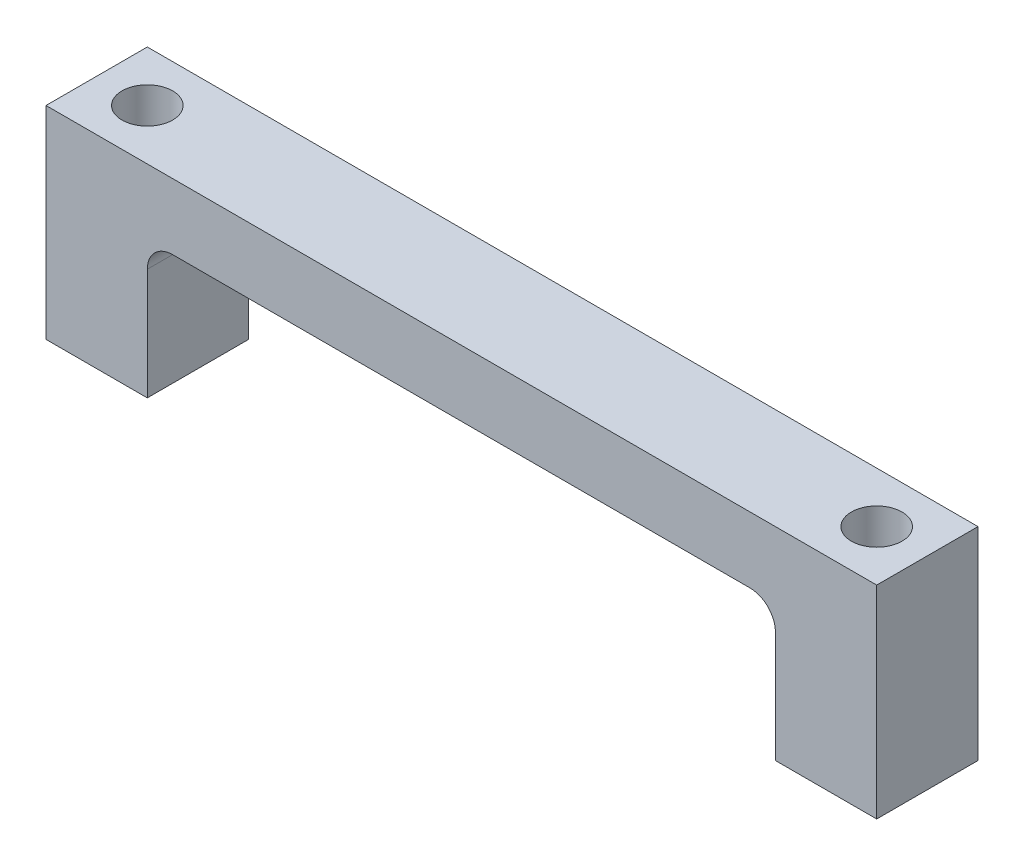
ISO-10303-21;
HEADER;
FILE_DESCRIPTION(('STEP AP214'),'2;1');
FILE_NAME('part.step','',(''),(''),'','','');
FILE_SCHEMA(('AUTOMOTIVE_DESIGN { 1 0 10303 214 1 1 1 1 }'));
ENDSEC;
DATA;
#1=APPLICATION_CONTEXT('core data for automotive mechanical design processes');
#2=APPLICATION_PROTOCOL_DEFINITION('international standard','automotive_design',2000,#1);
#3=PRODUCT_CONTEXT('',#1,'mechanical');
#4=PRODUCT('Part','Part','',(#3));
#5=PRODUCT_RELATED_PRODUCT_CATEGORY('part','',(#4));
#6=PRODUCT_DEFINITION_FORMATION('','',#4);
#7=PRODUCT_DEFINITION_CONTEXT('part definition',#1,'design');
#8=PRODUCT_DEFINITION('design','',#6,#7);
#9=PRODUCT_DEFINITION_SHAPE('','',#8);
#10=(LENGTH_UNIT() NAMED_UNIT(*) SI_UNIT(.MILLI.,.METRE.));
#11=(NAMED_UNIT(*) PLANE_ANGLE_UNIT() SI_UNIT($,.RADIAN.));
#12=(NAMED_UNIT(*) SI_UNIT($,.STERADIAN.) SOLID_ANGLE_UNIT());
#13=UNCERTAINTY_MEASURE_WITH_UNIT(LENGTH_MEASURE(1.E-05),#10,'distance_accuracy_value','');
#14=(GEOMETRIC_REPRESENTATION_CONTEXT(3) GLOBAL_UNCERTAINTY_ASSIGNED_CONTEXT((#13)) GLOBAL_UNIT_ASSIGNED_CONTEXT((#10,
#11,#12)) REPRESENTATION_CONTEXT('',''));
#15=CARTESIAN_POINT('',(0.,0.,0.));
#16=DIRECTION('',(0.,0.,1.));
#17=DIRECTION('',(1.,0.,0.));
#18=AXIS2_PLACEMENT_3D('',#15,#16,#17);
#19=CARTESIAN_POINT('',(0.,6.5,10.));
#20=DIRECTION('',(0.,-1.,0.));
#21=DIRECTION('',(1.,0.,0.));
#22=AXIS2_PLACEMENT_3D('',#19,#20,#21);
#23=PLANE('',#22);
#24=CARTESIAN_POINT('',(-36.,6.5,5.));
#25=DIRECTION('',(0.,1.,0.));
#26=DIRECTION('',(-1.,0.,0.));
#27=AXIS2_PLACEMENT_3D('',#24,#25,#26);
#28=CIRCLE('',#27,2.5);
#29=CARTESIAN_POINT('',(-38.5,6.5,5.));
#30=VERTEX_POINT('',#29);
#31=EDGE_CURVE('E217',#30,#30,#28,.T.);
#32=ORIENTED_EDGE('',*,*,#31,.F.);
#33=EDGE_LOOP('',(#32));
#34=FACE_BOUND('',#33,.T.);
#35=CARTESIAN_POINT('',(36.,6.50000000000001,5.));
#36=DIRECTION('',(0.,1.,0.));
#37=DIRECTION('',(-1.,0.,0.));
#38=AXIS2_PLACEMENT_3D('',#35,#36,#37);
#39=CIRCLE('',#38,2.5);
#40=CARTESIAN_POINT('',(33.5,6.50000000000001,5.));
#41=VERTEX_POINT('',#40);
#42=EDGE_CURVE('E214',#41,#41,#39,.T.);
#43=ORIENTED_EDGE('',*,*,#42,.F.);
#44=EDGE_LOOP('',(#43));
#45=FACE_BOUND('',#44,.T.);
#46=DIRECTION('',(-1.,0.,0.));
#47=VECTOR('',#46,1.);
#48=CARTESIAN_POINT('',(0.,6.5,0.));
#49=LINE('',#48,#47);
#50=CARTESIAN_POINT('',(41.,6.50000000000001,0.));
#51=VERTEX_POINT('',#50);
#52=CARTESIAN_POINT('',(-41.,6.5,0.));
#53=VERTEX_POINT('',#52);
#54=EDGE_CURVE('E135',#51,#53,#49,.T.);
#55=ORIENTED_EDGE('',*,*,#54,.T.);
#56=DIRECTION('',(0.,0.,-1.));
#57=VECTOR('',#56,1.);
#58=CARTESIAN_POINT('',(-41.,6.5,10.));
#59=LINE('',#58,#57);
#60=CARTESIAN_POINT('',(-41.,6.5,10.));
#61=VERTEX_POINT('',#60);
#62=EDGE_CURVE('E116',#61,#53,#59,.T.);
#63=ORIENTED_EDGE('',*,*,#62,.F.);
#64=DIRECTION('',(-1.,0.,0.));
#65=VECTOR('',#64,1.);
#66=CARTESIAN_POINT('',(0.,6.5,10.));
#67=LINE('',#66,#65);
#68=CARTESIAN_POINT('',(41.,6.50000000000001,10.));
#69=VERTEX_POINT('',#68);
#70=EDGE_CURVE('E123',#69,#61,#67,.T.);
#71=ORIENTED_EDGE('',*,*,#70,.F.);
#72=DIRECTION('',(0.,0.,-1.));
#73=VECTOR('',#72,1.);
#74=CARTESIAN_POINT('',(41.,6.50000000000001,10.));
#75=LINE('',#74,#73);
#76=EDGE_CURVE('E191',#69,#51,#75,.T.);
#77=ORIENTED_EDGE('',*,*,#76,.T.);
#78=EDGE_LOOP('',(#55,#63,#71,#77));
#79=FACE_BOUND('',#78,.T.);
#80=ADVANCED_FACE('F35',(#34,#45,#79),#23,.F.);
#81=CARTESIAN_POINT('',(-41.,0.,10.));
#82=DIRECTION('',(1.,0.,0.));
#83=DIRECTION('',(0.,1.,0.));
#84=AXIS2_PLACEMENT_3D('',#81,#82,#83);
#85=PLANE('',#84);
#86=DIRECTION('',(0.,-1.,0.));
#87=VECTOR('',#86,1.);
#88=CARTESIAN_POINT('',(-41.,0.,0.));
#89=LINE('',#88,#87);
#90=CARTESIAN_POINT('',(-41.,-13.5,0.));
#91=VERTEX_POINT('',#90);
#92=EDGE_CURVE('E201',#53,#91,#89,.T.);
#93=ORIENTED_EDGE('',*,*,#92,.T.);
#94=DIRECTION('',(0.,0.,-1.));
#95=VECTOR('',#94,1.);
#96=CARTESIAN_POINT('',(-41.,-13.5,10.));
#97=LINE('',#96,#95);
#98=CARTESIAN_POINT('',(-41.,-13.5,10.));
#99=VERTEX_POINT('',#98);
#100=EDGE_CURVE('E119',#99,#91,#97,.T.);
#101=ORIENTED_EDGE('',*,*,#100,.F.);
#102=DIRECTION('',(0.,-1.,0.));
#103=VECTOR('',#102,1.);
#104=CARTESIAN_POINT('',(-41.,0.,10.));
#105=LINE('',#104,#103);
#106=EDGE_CURVE('E112',#61,#99,#105,.T.);
#107=ORIENTED_EDGE('',*,*,#106,.F.);
#108=ORIENTED_EDGE('',*,*,#62,.T.);
#109=EDGE_LOOP('',(#93,#101,#107,#108));
#110=FACE_BOUND('',#109,.T.);
#111=ADVANCED_FACE('F114',(#110),#85,.F.);
#112=CARTESIAN_POINT('',(0.,-13.5,10.));
#113=DIRECTION('',(0.,1.,0.));
#114=DIRECTION('',(0.,0.,1.));
#115=AXIS2_PLACEMENT_3D('',#112,#113,#114);
#116=PLANE('',#115);
#117=CARTESIAN_POINT('',(-36.,-13.5,5.));
#118=DIRECTION('',(0.,1.,0.));
#119=DIRECTION('',(0.,0.,1.));
#120=AXIS2_PLACEMENT_3D('',#117,#118,#119);
#121=CIRCLE('',#120,2.5);
#122=CARTESIAN_POINT('',(-36.,-13.5,7.5));
#123=VERTEX_POINT('',#122);
#124=EDGE_CURVE('E205',#123,#123,#121,.F.);
#125=ORIENTED_EDGE('',*,*,#124,.F.);
#126=EDGE_LOOP('',(#125));
#127=FACE_BOUND('',#126,.T.);
#128=DIRECTION('',(1.,0.,0.));
#129=VECTOR('',#128,1.);
#130=CARTESIAN_POINT('',(0.,-13.5,0.));
#131=LINE('',#130,#129);
#132=CARTESIAN_POINT('',(-31.,-13.5,0.));
#133=VERTEX_POINT('',#132);
#134=EDGE_CURVE('E184',#91,#133,#131,.T.);
#135=ORIENTED_EDGE('',*,*,#134,.T.);
#136=DIRECTION('',(0.,0.,-1.));
#137=VECTOR('',#136,1.);
#138=CARTESIAN_POINT('',(-31.,-13.5,10.));
#139=LINE('',#138,#137);
#140=CARTESIAN_POINT('',(-31.,-13.5,10.));
#141=VERTEX_POINT('',#140);
#142=EDGE_CURVE('E141',#141,#133,#139,.T.);
#143=ORIENTED_EDGE('',*,*,#142,.F.);
#144=DIRECTION('',(1.,0.,0.));
#145=VECTOR('',#144,1.);
#146=CARTESIAN_POINT('',(0.,-13.5,10.));
#147=LINE('',#146,#145);
#148=EDGE_CURVE('E122',#99,#141,#147,.T.);
#149=ORIENTED_EDGE('',*,*,#148,.F.);
#150=ORIENTED_EDGE('',*,*,#100,.T.);
#151=EDGE_LOOP('',(#135,#143,#149,#150));
#152=FACE_BOUND('',#151,.T.);
#153=ADVANCED_FACE('F261',(#127,#152),#116,.F.);
#154=CARTESIAN_POINT('',(-31.,0.,10.));
#155=DIRECTION('',(-1.,0.,0.));
#156=DIRECTION('',(0.,0.,1.));
#157=AXIS2_PLACEMENT_3D('',#154,#155,#156);
#158=PLANE('',#157);
#159=DIRECTION('',(0.,1.,0.));
#160=VECTOR('',#159,1.);
#161=CARTESIAN_POINT('',(-31.,0.,0.));
#162=LINE('',#161,#160);
#163=CARTESIAN_POINT('',(-31.,-2.5,0.));
#164=VERTEX_POINT('',#163);
#165=EDGE_CURVE('E180',#133,#164,#162,.T.);
#166=ORIENTED_EDGE('',*,*,#165,.T.);
#167=DIRECTION('',(0.,0.,-1.));
#168=VECTOR('',#167,1.);
#169=CARTESIAN_POINT('',(-31.,-2.5,10.));
#170=LINE('',#169,#168);
#171=CARTESIAN_POINT('',(-31.,-2.5,10.));
#172=VERTEX_POINT('',#171);
#173=EDGE_CURVE('E50',#164,#172,#170,.F.);
#174=ORIENTED_EDGE('',*,*,#173,.T.);
#175=DIRECTION('',(0.,1.,0.));
#176=VECTOR('',#175,1.);
#177=CARTESIAN_POINT('',(-31.,0.,10.));
#178=LINE('',#177,#176);
#179=EDGE_CURVE('E198',#141,#172,#178,.T.);
#180=ORIENTED_EDGE('',*,*,#179,.F.);
#181=ORIENTED_EDGE('',*,*,#142,.T.);
#182=EDGE_LOOP('',(#166,#174,#180,#181));
#183=FACE_BOUND('',#182,.T.);
#184=ADVANCED_FACE('F197',(#183),#158,.F.);
#185=CARTESIAN_POINT('',(0.,0.,10.));
#186=DIRECTION('',(0.,1.,0.));
#187=DIRECTION('',(-1.,0.,0.));
#188=AXIS2_PLACEMENT_3D('',#185,#186,#187);
#189=PLANE('',#188);
#190=DIRECTION('',(1.,0.,0.));
#191=VECTOR('',#190,1.);
#192=CARTESIAN_POINT('',(0.,0.,0.));
#193=LINE('',#192,#191);
#194=CARTESIAN_POINT('',(-28.5,0.,0.));
#195=VERTEX_POINT('',#194);
#196=CARTESIAN_POINT('',(28.5,0.,0.));
#197=VERTEX_POINT('',#196);
#198=EDGE_CURVE('E174',#195,#197,#193,.T.);
#199=ORIENTED_EDGE('',*,*,#198,.T.);
#200=DIRECTION('',(0.,0.,-1.));
#201=VECTOR('',#200,1.);
#202=CARTESIAN_POINT('',(28.5,0.,10.));
#203=LINE('',#202,#201);
#204=CARTESIAN_POINT('',(28.5,0.,10.));
#205=VERTEX_POINT('',#204);
#206=EDGE_CURVE('E147',#197,#205,#203,.F.);
#207=ORIENTED_EDGE('',*,*,#206,.T.);
#208=DIRECTION('',(1.,0.,0.));
#209=VECTOR('',#208,1.);
#210=CARTESIAN_POINT('',(0.,0.,10.));
#211=LINE('',#210,#209);
#212=CARTESIAN_POINT('',(-28.5,0.,10.));
#213=VERTEX_POINT('',#212);
#214=EDGE_CURVE('E160',#213,#205,#211,.T.);
#215=ORIENTED_EDGE('',*,*,#214,.F.);
#216=DIRECTION('',(0.,0.,-1.));
#217=VECTOR('',#216,1.);
#218=CARTESIAN_POINT('',(-28.5,0.,0.));
#219=LINE('',#218,#217);
#220=EDGE_CURVE('E139',#213,#195,#219,.T.);
#221=ORIENTED_EDGE('',*,*,#220,.T.);
#222=EDGE_LOOP('',(#199,#207,#215,#221));
#223=FACE_BOUND('',#222,.T.);
#224=ADVANCED_FACE('F178',(#223),#189,.F.);
#225=CARTESIAN_POINT('',(31.,0.,10.));
#226=DIRECTION('',(-1.,0.,0.));
#227=DIRECTION('',(0.,0.,1.));
#228=AXIS2_PLACEMENT_3D('',#225,#226,#227);
#229=PLANE('',#228);
#230=DIRECTION('',(0.,1.,0.));
#231=VECTOR('',#230,1.);
#232=CARTESIAN_POINT('',(31.,0.,10.));
#233=LINE('',#232,#231);
#234=CARTESIAN_POINT('',(31.,-13.5,10.));
#235=VERTEX_POINT('',#234);
#236=CARTESIAN_POINT('',(31.,-2.5,10.));
#237=VERTEX_POINT('',#236);
#238=EDGE_CURVE('E157',#235,#237,#233,.T.);
#239=ORIENTED_EDGE('',*,*,#238,.T.);
#240=DIRECTION('',(0.,0.,-1.));
#241=VECTOR('',#240,1.);
#242=CARTESIAN_POINT('',(31.,-2.5,10.));
#243=LINE('',#242,#241);
#244=CARTESIAN_POINT('',(31.,-2.5,0.));
#245=VERTEX_POINT('',#244);
#246=EDGE_CURVE('E136',#237,#245,#243,.T.);
#247=ORIENTED_EDGE('',*,*,#246,.T.);
#248=DIRECTION('',(0.,1.,0.));
#249=VECTOR('',#248,1.);
#250=CARTESIAN_POINT('',(31.,0.,0.));
#251=LINE('',#250,#249);
#252=CARTESIAN_POINT('',(31.,-13.5,0.));
#253=VERTEX_POINT('',#252);
#254=EDGE_CURVE('E176',#253,#245,#251,.T.);
#255=ORIENTED_EDGE('',*,*,#254,.F.);
#256=DIRECTION('',(0.,0.,-1.));
#257=VECTOR('',#256,1.);
#258=CARTESIAN_POINT('',(31.,-13.5,10.));
#259=LINE('',#258,#257);
#260=EDGE_CURVE('E168',#235,#253,#259,.T.);
#261=ORIENTED_EDGE('',*,*,#260,.F.);
#262=EDGE_LOOP('',(#239,#247,#255,#261));
#263=FACE_BOUND('',#262,.T.);
#264=ADVANCED_FACE('F165',(#263),#229,.T.);
#265=CARTESIAN_POINT('',(0.,-13.5,10.));
#266=DIRECTION('',(0.,-1.,0.));
#267=DIRECTION('',(1.,0.,0.));
#268=AXIS2_PLACEMENT_3D('',#265,#266,#267);
#269=PLANE('',#268);
#270=CARTESIAN_POINT('',(36.,-13.5,5.));
#271=DIRECTION('',(0.,-1.,0.));
#272=DIRECTION('',(1.,0.,0.));
#273=AXIS2_PLACEMENT_3D('',#270,#271,#272);
#274=CIRCLE('',#273,2.5);
#275=CARTESIAN_POINT('',(38.5,-13.5,5.));
#276=VERTEX_POINT('',#275);
#277=EDGE_CURVE('E211',#276,#276,#274,.F.);
#278=ORIENTED_EDGE('',*,*,#277,.T.);
#279=EDGE_LOOP('',(#278));
#280=FACE_BOUND('',#279,.T.);
#281=DIRECTION('',(-1.,0.,0.));
#282=VECTOR('',#281,1.);
#283=CARTESIAN_POINT('',(0.,-13.5,0.));
#284=LINE('',#283,#282);
#285=CARTESIAN_POINT('',(41.,-13.5,0.));
#286=VERTEX_POINT('',#285);
#287=EDGE_CURVE('E182',#286,#253,#284,.T.);
#288=ORIENTED_EDGE('',*,*,#287,.F.);
#289=DIRECTION('',(0.,0.,-1.));
#290=VECTOR('',#289,1.);
#291=CARTESIAN_POINT('',(41.,-13.5,10.));
#292=LINE('',#291,#290);
#293=CARTESIAN_POINT('',(41.,-13.5,10.));
#294=VERTEX_POINT('',#293);
#295=EDGE_CURVE('E193',#294,#286,#292,.T.);
#296=ORIENTED_EDGE('',*,*,#295,.F.);
#297=DIRECTION('',(-1.,0.,0.));
#298=VECTOR('',#297,1.);
#299=CARTESIAN_POINT('',(0.,-13.5,10.));
#300=LINE('',#299,#298);
#301=EDGE_CURVE('E169',#294,#235,#300,.T.);
#302=ORIENTED_EDGE('',*,*,#301,.T.);
#303=ORIENTED_EDGE('',*,*,#260,.T.);
#304=EDGE_LOOP('',(#288,#296,#302,#303));
#305=FACE_BOUND('',#304,.T.);
#306=ADVANCED_FACE('F250',(#280,#305),#269,.T.);
#307=CARTESIAN_POINT('',(41.,0.,10.));
#308=DIRECTION('',(1.,0.,0.));
#309=DIRECTION('',(0.,1.,0.));
#310=AXIS2_PLACEMENT_3D('',#307,#308,#309);
#311=PLANE('',#310);
#312=DIRECTION('',(0.,-1.,0.));
#313=VECTOR('',#312,1.);
#314=CARTESIAN_POINT('',(41.,0.,0.));
#315=LINE('',#314,#313);
#316=EDGE_CURVE('E132',#51,#286,#315,.T.);
#317=ORIENTED_EDGE('',*,*,#316,.F.);
#318=ORIENTED_EDGE('',*,*,#76,.F.);
#319=DIRECTION('',(0.,-1.,0.));
#320=VECTOR('',#319,1.);
#321=CARTESIAN_POINT('',(41.,0.,10.));
#322=LINE('',#321,#320);
#323=EDGE_CURVE('E130',#69,#294,#322,.T.);
#324=ORIENTED_EDGE('',*,*,#323,.T.);
#325=ORIENTED_EDGE('',*,*,#295,.T.);
#326=EDGE_LOOP('',(#317,#318,#324,#325));
#327=FACE_BOUND('',#326,.T.);
#328=ADVANCED_FACE('F245',(#327),#311,.T.);
#329=CARTESIAN_POINT('',(0.,0.,10.));
#330=DIRECTION('',(0.,0.,1.));
#331=DIRECTION('',(1.,0.,0.));
#332=AXIS2_PLACEMENT_3D('',#329,#330,#331);
#333=PLANE('',#332);
#334=ORIENTED_EDGE('',*,*,#70,.T.);
#335=ORIENTED_EDGE('',*,*,#106,.T.);
#336=ORIENTED_EDGE('',*,*,#148,.T.);
#337=ORIENTED_EDGE('',*,*,#179,.T.);
#338=CARTESIAN_POINT('',(-28.5,-2.5,10.));
#339=DIRECTION('',(0.,0.,1.));
#340=DIRECTION('',(1.,0.,0.));
#341=AXIS2_PLACEMENT_3D('',#338,#339,#340);
#342=CIRCLE('',#341,2.5);
#343=EDGE_CURVE('E11',#172,#213,#342,.F.);
#344=ORIENTED_EDGE('',*,*,#343,.T.);
#345=ORIENTED_EDGE('',*,*,#214,.T.);
#346=CARTESIAN_POINT('',(28.5,-2.5,10.));
#347=DIRECTION('',(0.,0.,1.));
#348=DIRECTION('',(1.,0.,0.));
#349=AXIS2_PLACEMENT_3D('',#346,#347,#348);
#350=CIRCLE('',#349,2.5);
#351=EDGE_CURVE('E152',#205,#237,#350,.F.);
#352=ORIENTED_EDGE('',*,*,#351,.T.);
#353=ORIENTED_EDGE('',*,*,#238,.F.);
#354=ORIENTED_EDGE('',*,*,#301,.F.);
#355=ORIENTED_EDGE('',*,*,#323,.F.);
#356=EDGE_LOOP('',(#334,#335,#336,#337,#344,#345,#352,#353,#354,#355));
#357=FACE_BOUND('',#356,.T.);
#358=ADVANCED_FACE('F127',(#357),#333,.T.);
#359=CARTESIAN_POINT('',(0.,0.,0.));
#360=DIRECTION('',(0.,0.,1.));
#361=DIRECTION('',(1.,0.,0.));
#362=AXIS2_PLACEMENT_3D('',#359,#360,#361);
#363=PLANE('',#362);
#364=ORIENTED_EDGE('',*,*,#54,.F.);
#365=ORIENTED_EDGE('',*,*,#316,.T.);
#366=ORIENTED_EDGE('',*,*,#287,.T.);
#367=ORIENTED_EDGE('',*,*,#254,.T.);
#368=CARTESIAN_POINT('',(28.5,-2.5,0.));
#369=DIRECTION('',(0.,0.,1.));
#370=DIRECTION('',(1.,0.,0.));
#371=AXIS2_PLACEMENT_3D('',#368,#369,#370);
#372=CIRCLE('',#371,2.5);
#373=EDGE_CURVE('E150',#245,#197,#372,.T.);
#374=ORIENTED_EDGE('',*,*,#373,.T.);
#375=ORIENTED_EDGE('',*,*,#198,.F.);
#376=CARTESIAN_POINT('',(-28.5,-2.5,0.));
#377=DIRECTION('',(0.,0.,1.));
#378=DIRECTION('',(1.,0.,0.));
#379=AXIS2_PLACEMENT_3D('',#376,#377,#378);
#380=CIRCLE('',#379,2.5);
#381=EDGE_CURVE('E43',#195,#164,#380,.T.);
#382=ORIENTED_EDGE('',*,*,#381,.T.);
#383=ORIENTED_EDGE('',*,*,#165,.F.);
#384=ORIENTED_EDGE('',*,*,#134,.F.);
#385=ORIENTED_EDGE('',*,*,#92,.F.);
#386=EDGE_LOOP('',(#364,#365,#366,#367,#374,#375,#382,#383,#384,#385));
#387=FACE_BOUND('',#386,.T.);
#388=ADVANCED_FACE('F173',(#387),#363,.F.);
#389=CARTESIAN_POINT('',(28.5,-2.5,10.));
#390=DIRECTION('',(0.,0.,-1.));
#391=DIRECTION('',(-1.,0.,0.));
#392=AXIS2_PLACEMENT_3D('',#389,#390,#391);
#393=CYLINDRICAL_SURFACE('',#392,2.5);
#394=ORIENTED_EDGE('',*,*,#351,.F.);
#395=ORIENTED_EDGE('',*,*,#206,.F.);
#396=ORIENTED_EDGE('',*,*,#373,.F.);
#397=ORIENTED_EDGE('',*,*,#246,.F.);
#398=EDGE_LOOP('',(#394,#395,#396,#397));
#399=FACE_BOUND('',#398,.T.);
#400=ADVANCED_FACE('F171',(#399),#393,.F.);
#401=CARTESIAN_POINT('',(-28.5,-2.5,10.));
#402=DIRECTION('',(0.,0.,1.));
#403=DIRECTION('',(1.,0.,0.));
#404=AXIS2_PLACEMENT_3D('',#401,#402,#403);
#405=CYLINDRICAL_SURFACE('',#404,2.5);
#406=ORIENTED_EDGE('',*,*,#343,.F.);
#407=ORIENTED_EDGE('',*,*,#173,.F.);
#408=ORIENTED_EDGE('',*,*,#381,.F.);
#409=ORIENTED_EDGE('',*,*,#220,.F.);
#410=EDGE_LOOP('',(#406,#407,#408,#409));
#411=FACE_BOUND('',#410,.T.);
#412=ADVANCED_FACE('F37',(#411),#405,.F.);
#413=CARTESIAN_POINT('',(36.,-13.501,5.));
#414=DIRECTION('',(0.,1.,0.));
#415=DIRECTION('',(-1.,0.,0.));
#416=AXIS2_PLACEMENT_3D('',#413,#414,#415);
#417=CYLINDRICAL_SURFACE('',#416,2.5);
#418=ORIENTED_EDGE('',*,*,#277,.F.);
#419=EDGE_LOOP('',(#418));
#420=FACE_BOUND('',#419,.T.);
#421=ORIENTED_EDGE('',*,*,#42,.T.);
#422=EDGE_LOOP('',(#421));
#423=FACE_BOUND('',#422,.T.);
#424=ADVANCED_FACE('F231',(#420,#423),#417,.F.);
#425=CARTESIAN_POINT('',(-36.,-13.501,5.));
#426=DIRECTION('',(0.,1.,0.));
#427=DIRECTION('',(-1.,0.,0.));
#428=AXIS2_PLACEMENT_3D('',#425,#426,#427);
#429=CYLINDRICAL_SURFACE('',#428,2.5);
#430=ORIENTED_EDGE('',*,*,#31,.T.);
#431=EDGE_LOOP('',(#430));
#432=FACE_BOUND('',#431,.T.);
#433=ORIENTED_EDGE('',*,*,#124,.T.);
#434=EDGE_LOOP('',(#433));
#435=FACE_BOUND('',#434,.T.);
#436=ADVANCED_FACE('F223',(#432,#435),#429,.F.);
#437=CLOSED_SHELL('',(#80,#111,#153,#184,#224,#264,#306,#328,#358,#388,#400,#412,#424,#436));
#438=MANIFOLD_SOLID_BREP('B2',#437);
#439=ADVANCED_BREP_SHAPE_REPRESENTATION('',(#18,#438),#14);
#440=SHAPE_DEFINITION_REPRESENTATION(#9,#439);
ENDSEC;
END-ISO-10303-21;
